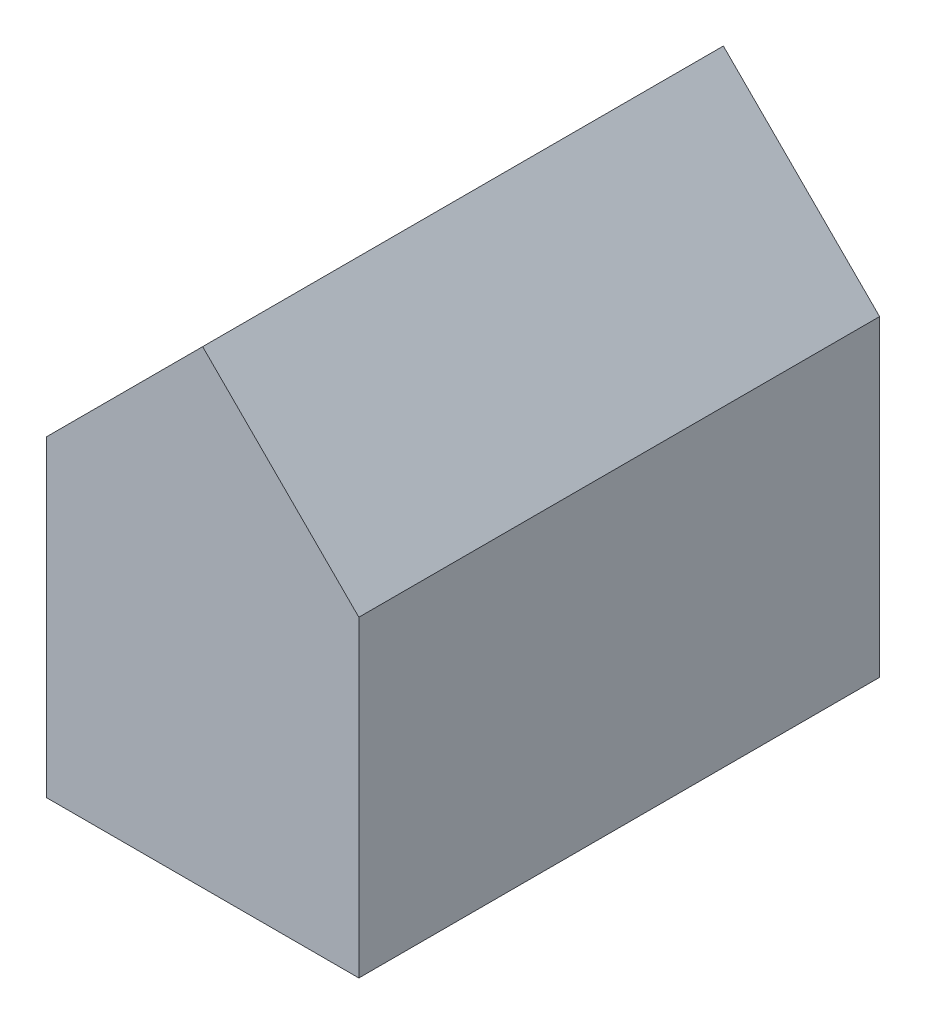
ISO-10303-21;
HEADER;
FILE_DESCRIPTION(('STEP AP214'),'2;1');
FILE_NAME('part.step','',(''),(''),'','','');
FILE_SCHEMA(('AUTOMOTIVE_DESIGN { 1 0 10303 214 1 1 1 1 }'));
ENDSEC;
DATA;
#1=APPLICATION_CONTEXT('core data for automotive mechanical design processes');
#2=APPLICATION_PROTOCOL_DEFINITION('international standard','automotive_design',2000,#1);
#3=PRODUCT_CONTEXT('',#1,'mechanical');
#4=PRODUCT('Part','Part','',(#3));
#5=PRODUCT_RELATED_PRODUCT_CATEGORY('part','',(#4));
#6=PRODUCT_DEFINITION_FORMATION('','',#4);
#7=PRODUCT_DEFINITION_CONTEXT('part definition',#1,'design');
#8=PRODUCT_DEFINITION('design','',#6,#7);
#9=PRODUCT_DEFINITION_SHAPE('','',#8);
#10=(LENGTH_UNIT() NAMED_UNIT(*) SI_UNIT(.MILLI.,.METRE.));
#11=(NAMED_UNIT(*) PLANE_ANGLE_UNIT() SI_UNIT($,.RADIAN.));
#12=(NAMED_UNIT(*) SI_UNIT($,.STERADIAN.) SOLID_ANGLE_UNIT());
#13=UNCERTAINTY_MEASURE_WITH_UNIT(LENGTH_MEASURE(1.E-05),#10,'distance_accuracy_value','');
#14=(GEOMETRIC_REPRESENTATION_CONTEXT(3) GLOBAL_UNCERTAINTY_ASSIGNED_CONTEXT((#13)) GLOBAL_UNIT_ASSIGNED_CONTEXT((#10,
#11,#12)) REPRESENTATION_CONTEXT('',''));
#15=CARTESIAN_POINT('',(0.,0.,0.));
#16=DIRECTION('',(0.,0.,1.));
#17=DIRECTION('',(1.,0.,0.));
#18=AXIS2_PLACEMENT_3D('',#15,#16,#17);
#19=CARTESIAN_POINT('',(-27.7113402061856,16.1030927835052,10.));
#20=DIRECTION('',(-0.707106781186549,0.707106781186546,0.));
#21=DIRECTION('',(-0.707106781186546,-0.707106781186549,0.));
#22=AXIS2_PLACEMENT_3D('',#19,#20,#21);
#23=PLANE('',#22);
#24=DIRECTION('',(0.707106781186546,0.707106781186549,0.));
#25=VECTOR('',#24,1.);
#26=CARTESIAN_POINT('',(-27.7113402061856,16.1030927835052,0.));
#27=LINE('',#26,#25);
#28=CARTESIAN_POINT('',(-27.7113402061856,16.1030927835052,0.));
#29=VERTEX_POINT('',#28);
#30=CARTESIAN_POINT('',(-24.7113402061856,19.1030927835052,0.));
#31=VERTEX_POINT('',#30);
#32=EDGE_CURVE('E112',#29,#31,#27,.T.);
#33=ORIENTED_EDGE('',*,*,#32,.F.);
#34=DIRECTION('',(0.,0.,-1.));
#35=VECTOR('',#34,1.);
#36=CARTESIAN_POINT('',(-27.7113402061856,16.1030927835052,10.));
#37=LINE('',#36,#35);
#38=CARTESIAN_POINT('',(-27.7113402061856,16.1030927835052,10.));
#39=VERTEX_POINT('',#38);
#40=EDGE_CURVE('E11',#39,#29,#37,.T.);
#41=ORIENTED_EDGE('',*,*,#40,.F.);
#42=DIRECTION('',(0.707106781186546,0.707106781186549,0.));
#43=VECTOR('',#42,1.);
#44=CARTESIAN_POINT('',(-27.7113402061856,16.1030927835052,10.));
#45=LINE('',#44,#43);
#46=CARTESIAN_POINT('',(-24.7113402061856,19.1030927835052,10.));
#47=VERTEX_POINT('',#46);
#48=EDGE_CURVE('E107',#39,#47,#45,.T.);
#49=ORIENTED_EDGE('',*,*,#48,.T.);
#50=DIRECTION('',(0.,0.,-1.));
#51=VECTOR('',#50,1.);
#52=CARTESIAN_POINT('',(-24.7113402061856,19.1030927835052,10.));
#53=LINE('',#52,#51);
#54=EDGE_CURVE('E36',#47,#31,#53,.T.);
#55=ORIENTED_EDGE('',*,*,#54,.T.);
#56=EDGE_LOOP('',(#33,#41,#49,#55));
#57=FACE_BOUND('',#56,.T.);
#58=ADVANCED_FACE('F33',(#57),#23,.T.);
#59=CARTESIAN_POINT('',(-27.7113402061856,16.1030927835052,10.));
#60=DIRECTION('',(1.,0.,0.));
#61=DIRECTION('',(0.,0.,-1.));
#62=AXIS2_PLACEMENT_3D('',#59,#60,#61);
#63=PLANE('',#62);
#64=DIRECTION('',(0.,-1.,0.));
#65=VECTOR('',#64,1.);
#66=CARTESIAN_POINT('',(-27.7113402061856,16.1030927835052,0.));
#67=LINE('',#66,#65);
#68=CARTESIAN_POINT('',(-27.7113402061856,10.1030927835052,0.));
#69=VERTEX_POINT('',#68);
#70=EDGE_CURVE('E69',#29,#69,#67,.T.);
#71=ORIENTED_EDGE('',*,*,#70,.T.);
#72=DIRECTION('',(0.,0.,-1.));
#73=VECTOR('',#72,1.);
#74=CARTESIAN_POINT('',(-27.7113402061856,10.1030927835052,10.));
#75=LINE('',#74,#73);
#76=CARTESIAN_POINT('',(-27.7113402061856,10.1030927835052,10.));
#77=VERTEX_POINT('',#76);
#78=EDGE_CURVE('E42',#77,#69,#75,.T.);
#79=ORIENTED_EDGE('',*,*,#78,.F.);
#80=DIRECTION('',(0.,-1.,0.));
#81=VECTOR('',#80,1.);
#82=CARTESIAN_POINT('',(-27.7113402061856,16.1030927835052,10.));
#83=LINE('',#82,#81);
#84=EDGE_CURVE('E91',#39,#77,#83,.T.);
#85=ORIENTED_EDGE('',*,*,#84,.F.);
#86=ORIENTED_EDGE('',*,*,#40,.T.);
#87=EDGE_LOOP('',(#71,#79,#85,#86));
#88=FACE_BOUND('',#87,.T.);
#89=ADVANCED_FACE('F133',(#88),#63,.F.);
#90=CARTESIAN_POINT('',(-27.7113402061856,10.1030927835052,10.));
#91=DIRECTION('',(0.,1.,0.));
#92=DIRECTION('',(0.,0.,1.));
#93=AXIS2_PLACEMENT_3D('',#90,#91,#92);
#94=PLANE('',#93);
#95=DIRECTION('',(1.,0.,0.));
#96=VECTOR('',#95,1.);
#97=CARTESIAN_POINT('',(-27.7113402061856,10.1030927835052,0.));
#98=LINE('',#97,#96);
#99=CARTESIAN_POINT('',(-21.7113402061856,10.1030927835052,0.));
#100=VERTEX_POINT('',#99);
#101=EDGE_CURVE('E98',#69,#100,#98,.T.);
#102=ORIENTED_EDGE('',*,*,#101,.T.);
#103=DIRECTION('',(0.,0.,-1.));
#104=VECTOR('',#103,1.);
#105=CARTESIAN_POINT('',(-21.7113402061856,10.1030927835052,10.));
#106=LINE('',#105,#104);
#107=CARTESIAN_POINT('',(-21.7113402061856,10.1030927835052,10.));
#108=VERTEX_POINT('',#107);
#109=EDGE_CURVE('E95',#108,#100,#106,.T.);
#110=ORIENTED_EDGE('',*,*,#109,.F.);
#111=DIRECTION('',(1.,0.,0.));
#112=VECTOR('',#111,1.);
#113=CARTESIAN_POINT('',(-27.7113402061856,10.1030927835052,10.));
#114=LINE('',#113,#112);
#115=EDGE_CURVE('E85',#77,#108,#114,.T.);
#116=ORIENTED_EDGE('',*,*,#115,.F.);
#117=ORIENTED_EDGE('',*,*,#78,.T.);
#118=EDGE_LOOP('',(#102,#110,#116,#117));
#119=FACE_BOUND('',#118,.T.);
#120=ADVANCED_FACE('F96',(#119),#94,.F.);
#121=CARTESIAN_POINT('',(-21.7113402061856,16.1030927835052,10.));
#122=DIRECTION('',(1.,0.,0.));
#123=DIRECTION('',(0.,1.,0.));
#124=AXIS2_PLACEMENT_3D('',#121,#122,#123);
#125=PLANE('',#124);
#126=DIRECTION('',(0.,-1.,0.));
#127=VECTOR('',#126,1.);
#128=CARTESIAN_POINT('',(-21.7113402061856,16.1030927835052,0.));
#129=LINE('',#128,#127);
#130=CARTESIAN_POINT('',(-21.7113402061856,16.1030927835052,0.));
#131=VERTEX_POINT('',#130);
#132=EDGE_CURVE('E118',#131,#100,#129,.T.);
#133=ORIENTED_EDGE('',*,*,#132,.F.);
#134=DIRECTION('',(0.,0.,-1.));
#135=VECTOR('',#134,1.);
#136=CARTESIAN_POINT('',(-21.7113402061856,16.1030927835052,10.));
#137=LINE('',#136,#135);
#138=CARTESIAN_POINT('',(-21.7113402061856,16.1030927835052,10.));
#139=VERTEX_POINT('',#138);
#140=EDGE_CURVE('E102',#139,#131,#137,.T.);
#141=ORIENTED_EDGE('',*,*,#140,.F.);
#142=DIRECTION('',(0.,-1.,0.));
#143=VECTOR('',#142,1.);
#144=CARTESIAN_POINT('',(-21.7113402061856,16.1030927835052,10.));
#145=LINE('',#144,#143);
#146=EDGE_CURVE('E90',#139,#108,#145,.T.);
#147=ORIENTED_EDGE('',*,*,#146,.T.);
#148=ORIENTED_EDGE('',*,*,#109,.T.);
#149=EDGE_LOOP('',(#133,#141,#147,#148));
#150=FACE_BOUND('',#149,.T.);
#151=ADVANCED_FACE('F104',(#150),#125,.T.);
#152=CARTESIAN_POINT('',(-24.7113402061856,19.1030927835052,10.));
#153=DIRECTION('',(0.707106781186548,0.707106781186547,0.));
#154=DIRECTION('',(-0.707106781186547,0.707106781186548,0.));
#155=AXIS2_PLACEMENT_3D('',#152,#153,#154);
#156=PLANE('',#155);
#157=DIRECTION('',(0.707106781186547,-0.707106781186548,0.));
#158=VECTOR('',#157,1.);
#159=CARTESIAN_POINT('',(-24.7113402061856,19.1030927835052,0.));
#160=LINE('',#159,#158);
#161=EDGE_CURVE('E115',#31,#131,#160,.T.);
#162=ORIENTED_EDGE('',*,*,#161,.F.);
#163=ORIENTED_EDGE('',*,*,#54,.F.);
#164=DIRECTION('',(0.707106781186547,-0.707106781186548,0.));
#165=VECTOR('',#164,1.);
#166=CARTESIAN_POINT('',(-24.7113402061856,19.1030927835052,10.));
#167=LINE('',#166,#165);
#168=EDGE_CURVE('E105',#47,#139,#167,.T.);
#169=ORIENTED_EDGE('',*,*,#168,.T.);
#170=ORIENTED_EDGE('',*,*,#140,.T.);
#171=EDGE_LOOP('',(#162,#163,#169,#170));
#172=FACE_BOUND('',#171,.T.);
#173=ADVANCED_FACE('F122',(#172),#156,.T.);
#174=CARTESIAN_POINT('',(0.,0.,10.));
#175=DIRECTION('',(0.,0.,-1.));
#176=DIRECTION('',(-1.,0.,0.));
#177=AXIS2_PLACEMENT_3D('',#174,#175,#176);
#178=PLANE('',#177);
#179=ORIENTED_EDGE('',*,*,#48,.F.);
#180=ORIENTED_EDGE('',*,*,#84,.T.);
#181=ORIENTED_EDGE('',*,*,#115,.T.);
#182=ORIENTED_EDGE('',*,*,#146,.F.);
#183=ORIENTED_EDGE('',*,*,#168,.F.);
#184=EDGE_LOOP('',(#179,#180,#181,#182,#183));
#185=FACE_BOUND('',#184,.T.);
#186=ADVANCED_FACE('F88',(#185),#178,.F.);
#187=CARTESIAN_POINT('',(0.,0.,0.));
#188=DIRECTION('',(0.,0.,-1.));
#189=DIRECTION('',(-1.,0.,0.));
#190=AXIS2_PLACEMENT_3D('',#187,#188,#189);
#191=PLANE('',#190);
#192=ORIENTED_EDGE('',*,*,#32,.T.);
#193=ORIENTED_EDGE('',*,*,#161,.T.);
#194=ORIENTED_EDGE('',*,*,#132,.T.);
#195=ORIENTED_EDGE('',*,*,#101,.F.);
#196=ORIENTED_EDGE('',*,*,#70,.F.);
#197=EDGE_LOOP('',(#192,#193,#194,#195,#196));
#198=FACE_BOUND('',#197,.T.);
#199=ADVANCED_FACE('F124',(#198),#191,.T.);
#200=CLOSED_SHELL('',(#58,#89,#120,#151,#173,#186,#199));
#201=MANIFOLD_SOLID_BREP('B2',#200);
#202=ADVANCED_BREP_SHAPE_REPRESENTATION('',(#18,#201),#14);
#203=SHAPE_DEFINITION_REPRESENTATION(#9,#202);
ENDSEC;
END-ISO-10303-21;
